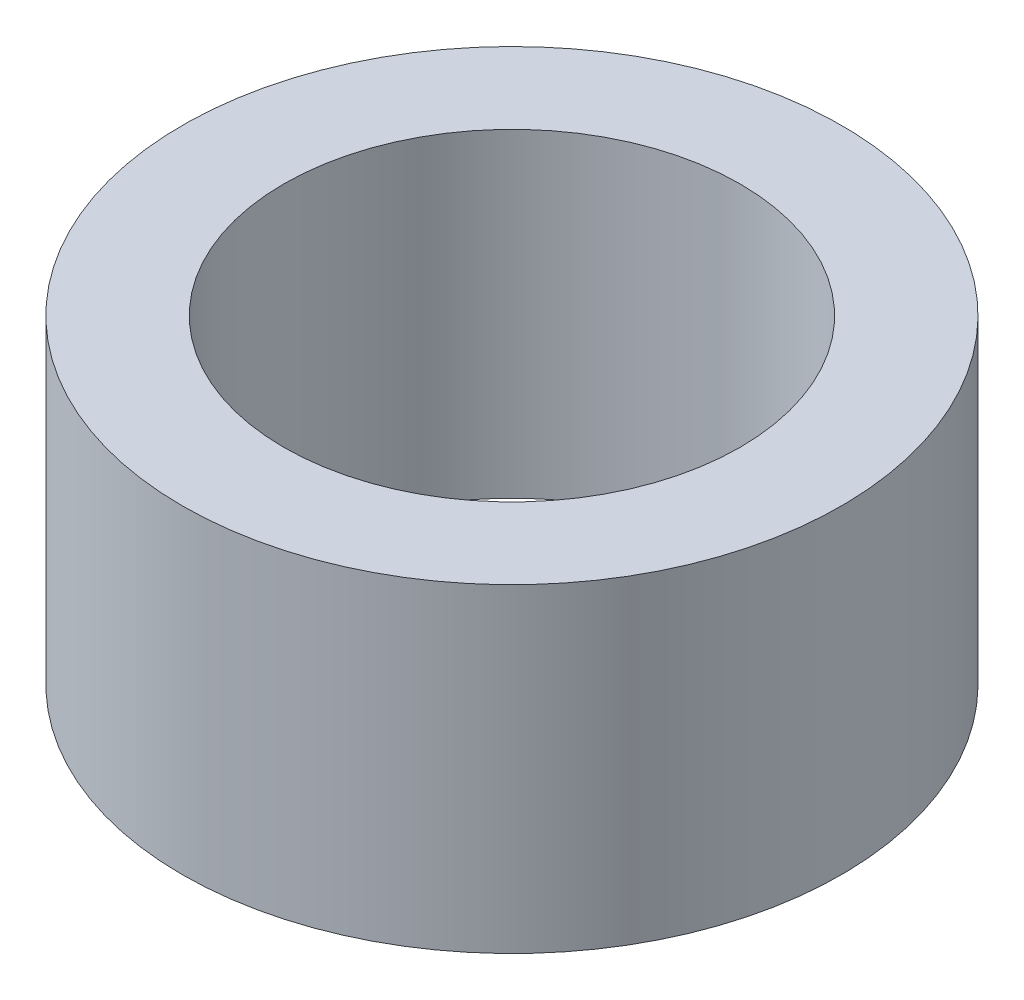
ISO-10303-21;
HEADER;
FILE_DESCRIPTION(('STEP AP214'),'2;1');
FILE_NAME('part.step','',(''),(''),'','','');
FILE_SCHEMA(('AUTOMOTIVE_DESIGN { 1 0 10303 214 1 1 1 1 }'));
ENDSEC;
DATA;
#1=APPLICATION_CONTEXT('core data for automotive mechanical design processes');
#2=APPLICATION_PROTOCOL_DEFINITION('international standard','automotive_design',2000,#1);
#3=PRODUCT_CONTEXT('',#1,'mechanical');
#4=PRODUCT('Part','Part','',(#3));
#5=PRODUCT_RELATED_PRODUCT_CATEGORY('part','',(#4));
#6=PRODUCT_DEFINITION_FORMATION('','',#4);
#7=PRODUCT_DEFINITION_CONTEXT('part definition',#1,'design');
#8=PRODUCT_DEFINITION('design','',#6,#7);
#9=PRODUCT_DEFINITION_SHAPE('','',#8);
#10=(LENGTH_UNIT() NAMED_UNIT(*) SI_UNIT(.MILLI.,.METRE.));
#11=(NAMED_UNIT(*) PLANE_ANGLE_UNIT() SI_UNIT($,.RADIAN.));
#12=(NAMED_UNIT(*) SI_UNIT($,.STERADIAN.) SOLID_ANGLE_UNIT());
#13=UNCERTAINTY_MEASURE_WITH_UNIT(LENGTH_MEASURE(1.E-05),#10,'distance_accuracy_value','');
#14=(GEOMETRIC_REPRESENTATION_CONTEXT(3) GLOBAL_UNCERTAINTY_ASSIGNED_CONTEXT((#13)) GLOBAL_UNIT_ASSIGNED_CONTEXT((#10,
#11,#12)) REPRESENTATION_CONTEXT('',''));
#15=CARTESIAN_POINT('',(0.,0.,0.));
#16=DIRECTION('',(0.,0.,1.));
#17=DIRECTION('',(1.,0.,0.));
#18=AXIS2_PLACEMENT_3D('',#15,#16,#17);
#19=CARTESIAN_POINT('',(-1.52616580883169,12.6,-3.0523316176633));
#20=DIRECTION('',(0.,1.,0.));
#21=DIRECTION('',(0.,0.,1.));
#22=AXIS2_PLACEMENT_3D('',#19,#20,#21);
#23=PLANE('',#22);
#24=CARTESIAN_POINT('',(-1.52616580883169,12.6,-3.0523316176633));
#25=DIRECTION('',(0.,1.,0.));
#26=DIRECTION('',(0.,0.,1.));
#27=AXIS2_PLACEMENT_3D('',#24,#25,#26);
#28=CIRCLE('',#27,13.);
#29=CARTESIAN_POINT('',(-1.52616580883169,12.6,9.9476683823367));
#30=VERTEX_POINT('',#29);
#31=EDGE_CURVE('E10',#30,#30,#28,.T.);
#32=ORIENTED_EDGE('',*,*,#31,.T.);
#33=EDGE_LOOP('',(#32));
#34=FACE_BOUND('',#33,.T.);
#35=CARTESIAN_POINT('',(-1.52616580883169,12.6,-3.0523316176633));
#36=DIRECTION('',(0.,1.,0.));
#37=DIRECTION('',(0.,0.,1.));
#38=AXIS2_PLACEMENT_3D('',#35,#36,#37);
#39=CIRCLE('',#38,9.);
#40=CARTESIAN_POINT('',(-1.52616580883169,12.6,5.9476683823367));
#41=VERTEX_POINT('',#40);
#42=EDGE_CURVE('E46',#41,#41,#39,.T.);
#43=ORIENTED_EDGE('',*,*,#42,.F.);
#44=EDGE_LOOP('',(#43));
#45=FACE_BOUND('',#44,.T.);
#46=ADVANCED_FACE('F35',(#34,#45),#23,.T.);
#47=CARTESIAN_POINT('',(-1.52616580883169,0.,-3.0523316176633));
#48=DIRECTION('',(0.,1.,0.));
#49=DIRECTION('',(0.,0.,1.));
#50=AXIS2_PLACEMENT_3D('',#47,#48,#49);
#51=PLANE('',#50);
#52=CARTESIAN_POINT('',(-1.52616580883169,0.,-3.0523316176633));
#53=DIRECTION('',(0.,1.,0.));
#54=DIRECTION('',(0.,0.,1.));
#55=AXIS2_PLACEMENT_3D('',#52,#53,#54);
#56=CIRCLE('',#55,13.);
#57=CARTESIAN_POINT('',(-1.52616580883169,0.,9.9476683823367));
#58=VERTEX_POINT('',#57);
#59=EDGE_CURVE('E39',#58,#58,#56,.T.);
#60=ORIENTED_EDGE('',*,*,#59,.F.);
#61=EDGE_LOOP('',(#60));
#62=FACE_BOUND('',#61,.T.);
#63=CARTESIAN_POINT('',(-1.52616580883169,0.,-3.0523316176633));
#64=DIRECTION('',(0.,1.,0.));
#65=DIRECTION('',(0.,0.,1.));
#66=AXIS2_PLACEMENT_3D('',#63,#64,#65);
#67=CIRCLE('',#66,9.);
#68=CARTESIAN_POINT('',(-1.52616580883169,0.,5.9476683823367));
#69=VERTEX_POINT('',#68);
#70=EDGE_CURVE('E48',#69,#69,#67,.T.);
#71=ORIENTED_EDGE('',*,*,#70,.T.);
#72=EDGE_LOOP('',(#71));
#73=FACE_BOUND('',#72,.T.);
#74=ADVANCED_FACE('F58',(#62,#73),#51,.F.);
#75=CARTESIAN_POINT('',(-1.52616580883169,12.6,-3.0523316176633));
#76=DIRECTION('',(0.,-1.,0.));
#77=DIRECTION('',(0.,0.,-1.));
#78=AXIS2_PLACEMENT_3D('',#75,#76,#77);
#79=CYLINDRICAL_SURFACE('',#78,13.);
#80=ORIENTED_EDGE('',*,*,#31,.F.);
#81=EDGE_LOOP('',(#80));
#82=FACE_BOUND('',#81,.T.);
#83=ORIENTED_EDGE('',*,*,#59,.T.);
#84=EDGE_LOOP('',(#83));
#85=FACE_BOUND('',#84,.T.);
#86=ADVANCED_FACE('F37',(#82,#85),#79,.T.);
#87=CARTESIAN_POINT('',(-1.52616580883169,12.6,-3.0523316176633));
#88=DIRECTION('',(0.,-1.,0.));
#89=DIRECTION('',(0.,0.,-1.));
#90=AXIS2_PLACEMENT_3D('',#87,#88,#89);
#91=CYLINDRICAL_SURFACE('',#90,9.);
#92=ORIENTED_EDGE('',*,*,#42,.T.);
#93=EDGE_LOOP('',(#92));
#94=FACE_BOUND('',#93,.T.);
#95=ORIENTED_EDGE('',*,*,#70,.F.);
#96=EDGE_LOOP('',(#95));
#97=FACE_BOUND('',#96,.T.);
#98=ADVANCED_FACE('F54',(#94,#97),#91,.F.);
#99=CLOSED_SHELL('',(#46,#74,#86,#98));
#100=MANIFOLD_SOLID_BREP('B2',#99);
#101=ADVANCED_BREP_SHAPE_REPRESENTATION('',(#18,#100),#14);
#102=SHAPE_DEFINITION_REPRESENTATION(#9,#101);
ENDSEC;
END-ISO-10303-21;
